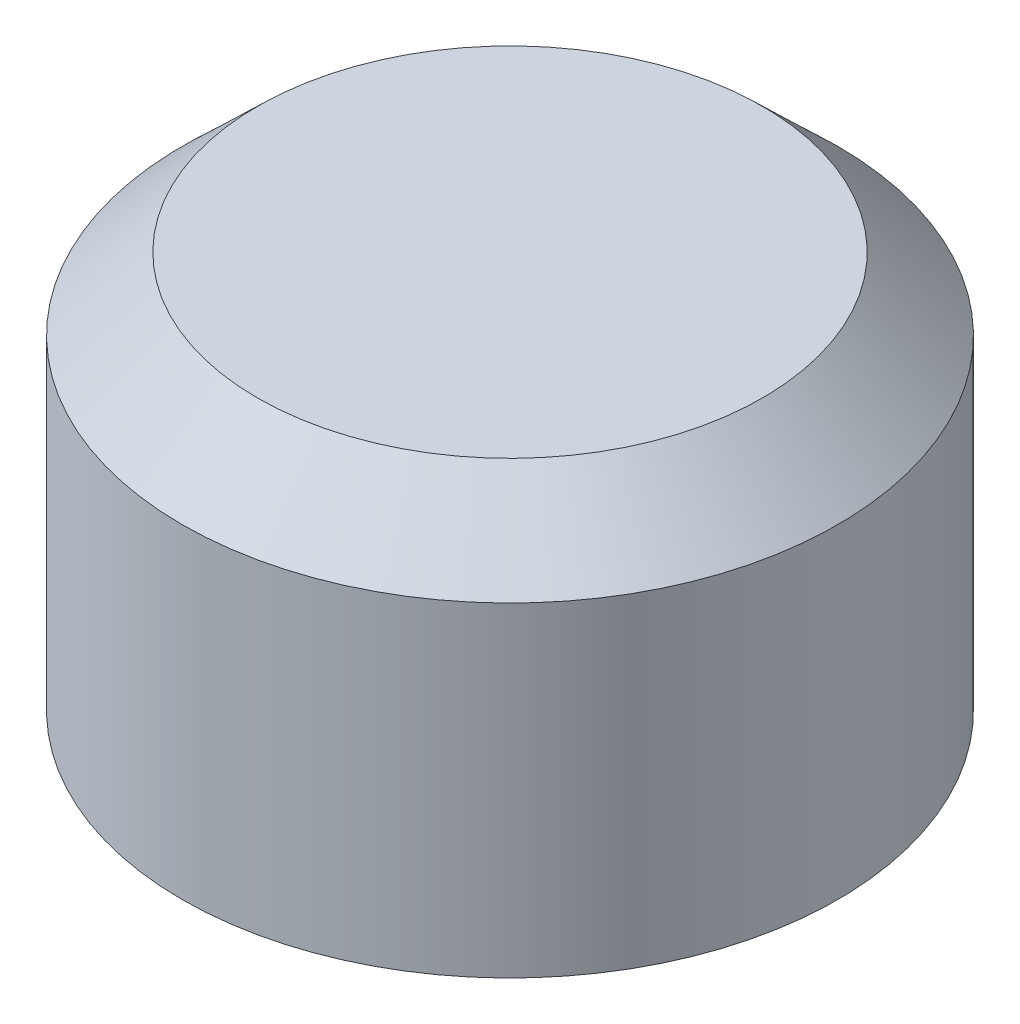
ISO-10303-21;
HEADER;
FILE_DESCRIPTION(('STEP AP214'),'2;1');
FILE_NAME('part.step','',(''),(''),'','','');
FILE_SCHEMA(('AUTOMOTIVE_DESIGN { 1 0 10303 214 1 1 1 1 }'));
ENDSEC;
DATA;
#1=APPLICATION_CONTEXT('core data for automotive mechanical design processes');
#2=APPLICATION_PROTOCOL_DEFINITION('international standard','automotive_design',2000,#1);
#3=PRODUCT_CONTEXT('',#1,'mechanical');
#4=PRODUCT('Part','Part','',(#3));
#5=PRODUCT_RELATED_PRODUCT_CATEGORY('part','',(#4));
#6=PRODUCT_DEFINITION_FORMATION('','',#4);
#7=PRODUCT_DEFINITION_CONTEXT('part definition',#1,'design');
#8=PRODUCT_DEFINITION('design','',#6,#7);
#9=PRODUCT_DEFINITION_SHAPE('','',#8);
#10=(LENGTH_UNIT() NAMED_UNIT(*) SI_UNIT(.MILLI.,.METRE.));
#11=(NAMED_UNIT(*) PLANE_ANGLE_UNIT() SI_UNIT($,.RADIAN.));
#12=(NAMED_UNIT(*) SI_UNIT($,.STERADIAN.) SOLID_ANGLE_UNIT());
#13=UNCERTAINTY_MEASURE_WITH_UNIT(LENGTH_MEASURE(1.E-05),#10,'distance_accuracy_value','');
#14=(GEOMETRIC_REPRESENTATION_CONTEXT(3) GLOBAL_UNCERTAINTY_ASSIGNED_CONTEXT((#13)) GLOBAL_UNIT_ASSIGNED_CONTEXT((#10,
#11,#12)) REPRESENTATION_CONTEXT('',''));
#15=CARTESIAN_POINT('',(0.,0.,0.));
#16=DIRECTION('',(0.,0.,1.));
#17=DIRECTION('',(1.,0.,0.));
#18=AXIS2_PLACEMENT_3D('',#15,#16,#17);
#19=CARTESIAN_POINT('',(0.,3520.44,0.));
#20=DIRECTION('',(0.,1.,0.));
#21=DIRECTION('',(0.,0.,1.));
#22=AXIS2_PLACEMENT_3D('',#19,#20,#21);
#23=CYLINDRICAL_SURFACE('',#22,2743.2);
#24=CARTESIAN_POINT('',(0.,2732.37406594724,0.));
#25=DIRECTION('',(0.,1.,0.));
#26=DIRECTION('',(0.,0.,1.));
#27=AXIS2_PLACEMENT_3D('',#24,#25,#26);
#28=CIRCLE('',#27,2743.2);
#29=CARTESIAN_POINT('',(0.,2732.37406594724,2743.2));
#30=VERTEX_POINT('',#29);
#31=EDGE_CURVE('E72',#30,#30,#28,.T.);
#32=ORIENTED_EDGE('',*,*,#31,.T.);
#33=EDGE_LOOP('',(#32));
#34=FACE_BOUND('',#33,.T.);
#35=CARTESIAN_POINT('',(0.,0.,0.));
#36=DIRECTION('',(0.,1.,0.));
#37=DIRECTION('',(0.,0.,1.));
#38=AXIS2_PLACEMENT_3D('',#35,#36,#37);
#39=CIRCLE('',#38,2743.2);
#40=CARTESIAN_POINT('',(0.,0.,2743.2));
#41=VERTEX_POINT('',#40);
#42=EDGE_CURVE('E11',#41,#41,#39,.T.);
#43=ORIENTED_EDGE('',*,*,#42,.F.);
#44=EDGE_LOOP('',(#43));
#45=FACE_BOUND('',#44,.T.);
#46=ADVANCED_FACE('F45',(#34,#45),#23,.F.);
#47=CARTESIAN_POINT('',(-2743.2,0.,0.));
#48=DIRECTION('',(0.,-1.,0.));
#49=DIRECTION('',(0.,0.,-1.));
#50=AXIS2_PLACEMENT_3D('',#47,#48,#49);
#51=PLANE('',#50);
#52=ORIENTED_EDGE('',*,*,#42,.T.);
#53=EDGE_LOOP('',(#52));
#54=FACE_BOUND('',#53,.T.);
#55=CARTESIAN_POINT('',(0.,0.,0.));
#56=DIRECTION('',(0.,1.,0.));
#57=DIRECTION('',(0.,0.,1.));
#58=AXIS2_PLACEMENT_3D('',#55,#56,#57);
#59=CIRCLE('',#58,2768.6);
#60=CARTESIAN_POINT('',(0.,0.,2768.6));
#61=VERTEX_POINT('',#60);
#62=EDGE_CURVE('E52',#61,#61,#59,.T.);
#63=ORIENTED_EDGE('',*,*,#62,.F.);
#64=EDGE_LOOP('',(#63));
#65=FACE_BOUND('',#64,.T.);
#66=ADVANCED_FACE('F91',(#54,#65),#51,.T.);
#67=CARTESIAN_POINT('',(0.,3520.44,0.));
#68=DIRECTION('',(0.,1.,0.));
#69=DIRECTION('',(0.,0.,1.));
#70=AXIS2_PLACEMENT_3D('',#67,#68,#69);
#71=CYLINDRICAL_SURFACE('',#70,2768.6);
#72=ORIENTED_EDGE('',*,*,#62,.T.);
#73=EDGE_LOOP('',(#72));
#74=FACE_BOUND('',#73,.T.);
#75=CARTESIAN_POINT('',(0.,2743.2,0.));
#76=DIRECTION('',(0.,1.,0.));
#77=DIRECTION('',(0.,0.,1.));
#78=AXIS2_PLACEMENT_3D('',#75,#76,#77);
#79=CIRCLE('',#78,2768.6);
#80=CARTESIAN_POINT('',(0.,2743.2,2768.6));
#81=VERTEX_POINT('',#80);
#82=EDGE_CURVE('E57',#81,#81,#79,.T.);
#83=ORIENTED_EDGE('',*,*,#82,.F.);
#84=EDGE_LOOP('',(#83));
#85=FACE_BOUND('',#84,.T.);
#86=ADVANCED_FACE('F95',(#74,#85),#71,.T.);
#87=CARTESIAN_POINT('',(0.,3352.8,0.));
#88=DIRECTION('',(0.,-1.,0.));
#89=DIRECTION('',(0.,0.,-1.));
#90=AXIS2_PLACEMENT_3D('',#87,#88,#89);
#91=CONICAL_SURFACE('',#90,2133.6,0.805803494083987);
#92=ORIENTED_EDGE('',*,*,#82,.T.);
#93=EDGE_LOOP('',(#92));
#94=FACE_BOUND('',#93,.T.);
#95=CARTESIAN_POINT('',(0.,3352.8,0.));
#96=DIRECTION('',(0.,1.,0.));
#97=DIRECTION('',(0.,0.,1.));
#98=AXIS2_PLACEMENT_3D('',#95,#96,#97);
#99=CIRCLE('',#98,2133.6);
#100=CARTESIAN_POINT('',(0.,3352.8,2133.6));
#101=VERTEX_POINT('',#100);
#102=EDGE_CURVE('E62',#101,#101,#99,.T.);
#103=ORIENTED_EDGE('',*,*,#102,.F.);
#104=EDGE_LOOP('',(#103));
#105=FACE_BOUND('',#104,.T.);
#106=ADVANCED_FACE('F99',(#94,#105),#91,.T.);
#107=CARTESIAN_POINT('',(0.,3352.8,0.));
#108=DIRECTION('',(0.,1.,0.));
#109=DIRECTION('',(0.,0.,1.));
#110=AXIS2_PLACEMENT_3D('',#107,#108,#109);
#111=PLANE('',#110);
#112=ORIENTED_EDGE('',*,*,#102,.T.);
#113=EDGE_LOOP('',(#112));
#114=FACE_BOUND('',#113,.T.);
#115=ADVANCED_FACE('F87',(#114),#111,.T.);
#116=CARTESIAN_POINT('',(-2123.38131869504,3327.4,0.));
#117=DIRECTION('',(0.,-1.,0.));
#118=DIRECTION('',(0.,0.,-1.));
#119=AXIS2_PLACEMENT_3D('',#116,#117,#118);
#120=PLANE('',#119);
#121=CARTESIAN_POINT('',(0.,3327.4,0.));
#122=DIRECTION('',(0.,1.,0.));
#123=DIRECTION('',(0.,0.,1.));
#124=AXIS2_PLACEMENT_3D('',#121,#122,#123);
#125=CIRCLE('',#124,2123.38131869504);
#126=CARTESIAN_POINT('',(0.,3327.4,2123.38131869504));
#127=VERTEX_POINT('',#126);
#128=EDGE_CURVE('E68',#127,#127,#125,.T.);
#129=ORIENTED_EDGE('',*,*,#128,.F.);
#130=EDGE_LOOP('',(#129));
#131=FACE_BOUND('',#130,.T.);
#132=ADVANCED_FACE('F81',(#131),#120,.T.);
#133=CARTESIAN_POINT('',(0.,2732.37406594724,0.));
#134=DIRECTION('',(0.,-1.,0.));
#135=DIRECTION('',(0.,0.,-1.));
#136=AXIS2_PLACEMENT_3D('',#133,#134,#135);
#137=CONICAL_SURFACE('',#136,2743.2,0.805803494083986);
#138=ORIENTED_EDGE('',*,*,#128,.T.);
#139=EDGE_LOOP('',(#138));
#140=FACE_BOUND('',#139,.T.);
#141=ORIENTED_EDGE('',*,*,#31,.F.);
#142=EDGE_LOOP('',(#141));
#143=FACE_BOUND('',#142,.T.);
#144=ADVANCED_FACE('F79',(#140,#143),#137,.F.);
#145=CLOSED_SHELL('',(#46,#66,#86,#106,#115,#132,#144));
#146=MANIFOLD_SOLID_BREP('B2',#145);
#147=CARTESIAN_POINT('',(-2413.,0.,0.));
#148=DIRECTION('',(0.,-1.,0.));
#149=DIRECTION('',(0.,0.,-1.));
#150=AXIS2_PLACEMENT_3D('',#147,#148,#149);
#151=PLANE('',#150);
#152=CARTESIAN_POINT('',(0.,0.,0.));
#153=DIRECTION('',(0.,1.,0.));
#154=DIRECTION('',(0.,0.,1.));
#155=AXIS2_PLACEMENT_3D('',#152,#153,#154);
#156=CIRCLE('',#155,2413.);
#157=CARTESIAN_POINT('',(0.,0.,2413.));
#158=VERTEX_POINT('',#157);
#159=EDGE_CURVE('E198',#158,#158,#156,.T.);
#160=ORIENTED_EDGE('',*,*,#159,.T.);
#161=EDGE_LOOP('',(#160));
#162=FACE_BOUND('',#161,.T.);
#163=CARTESIAN_POINT('',(0.,0.,0.));
#164=DIRECTION('',(0.,1.,0.));
#165=DIRECTION('',(0.,0.,1.));
#166=AXIS2_PLACEMENT_3D('',#163,#164,#165);
#167=CIRCLE('',#166,2438.4);
#168=CARTESIAN_POINT('',(0.,0.,2438.4));
#169=VERTEX_POINT('',#168);
#170=EDGE_CURVE('E44',#169,#169,#167,.T.);
#171=ORIENTED_EDGE('',*,*,#170,.F.);
#172=EDGE_LOOP('',(#171));
#173=FACE_BOUND('',#172,.T.);
#174=ADVANCED_FACE('F152',(#162,#173),#151,.T.);
#175=CARTESIAN_POINT('',(0.,3520.44,0.));
#176=DIRECTION('',(0.,1.,0.));
#177=DIRECTION('',(0.,0.,1.));
#178=AXIS2_PLACEMENT_3D('',#175,#176,#177);
#179=CYLINDRICAL_SURFACE('',#178,2438.4);
#180=ORIENTED_EDGE('',*,*,#170,.T.);
#181=EDGE_LOOP('',(#180));
#182=FACE_BOUND('',#181,.T.);
#183=CARTESIAN_POINT('',(0.,2753.72102448428,0.));
#184=DIRECTION('',(0.,1.,0.));
#185=DIRECTION('',(0.,0.,1.));
#186=AXIS2_PLACEMENT_3D('',#183,#184,#185);
#187=CIRCLE('',#186,2438.4);
#188=CARTESIAN_POINT('',(0.,2753.72102448428,2438.4));
#189=VERTEX_POINT('',#188);
#190=EDGE_CURVE('E158',#189,#189,#187,.T.);
#191=ORIENTED_EDGE('',*,*,#190,.F.);
#192=EDGE_LOOP('',(#191));
#193=FACE_BOUND('',#192,.T.);
#194=ADVANCED_FACE('F216',(#182,#193),#179,.T.);
#195=CARTESIAN_POINT('',(0.,3073.4,0.));
#196=DIRECTION('',(0.,-1.,0.));
#197=DIRECTION('',(0.,0.,-1.));
#198=AXIS2_PLACEMENT_3D('',#195,#196,#197);
#199=CONICAL_SURFACE('',#198,2118.72102448428,0.785398163397448);
#200=ORIENTED_EDGE('',*,*,#190,.T.);
#201=EDGE_LOOP('',(#200));
#202=FACE_BOUND('',#201,.T.);
#203=CARTESIAN_POINT('',(0.,3073.4,0.));
#204=DIRECTION('',(0.,1.,0.));
#205=DIRECTION('',(0.,0.,1.));
#206=AXIS2_PLACEMENT_3D('',#203,#204,#205);
#207=CIRCLE('',#206,2118.72102448428);
#208=CARTESIAN_POINT('',(0.,3073.4,2118.72102448428));
#209=VERTEX_POINT('',#208);
#210=EDGE_CURVE('E162',#209,#209,#207,.T.);
#211=ORIENTED_EDGE('',*,*,#210,.F.);
#212=EDGE_LOOP('',(#211));
#213=FACE_BOUND('',#212,.T.);
#214=ADVANCED_FACE('F220',(#202,#213),#199,.T.);
#215=CARTESIAN_POINT('',(-2118.72102448428,3073.4,0.));
#216=DIRECTION('',(0.,1.,0.));
#217=DIRECTION('',(0.,0.,1.));
#218=AXIS2_PLACEMENT_3D('',#215,#216,#217);
#219=PLANE('',#218);
#220=ORIENTED_EDGE('',*,*,#210,.T.);
#221=EDGE_LOOP('',(#220));
#222=FACE_BOUND('',#221,.T.);
#223=CARTESIAN_POINT('',(0.,3073.4,0.));
#224=DIRECTION('',(0.,1.,0.));
#225=DIRECTION('',(0.,0.,1.));
#226=AXIS2_PLACEMENT_3D('',#223,#224,#225);
#227=CIRCLE('',#226,1190.87720649982);
#228=CARTESIAN_POINT('',(0.,3073.4,1190.87720649982));
#229=VERTEX_POINT('',#228);
#230=EDGE_CURVE('E166',#229,#229,#227,.T.);
#231=ORIENTED_EDGE('',*,*,#230,.F.);
#232=EDGE_LOOP('',(#231));
#233=FACE_BOUND('',#232,.T.);
#234=ADVANCED_FACE('F224',(#222,#233),#219,.T.);
#235=CARTESIAN_POINT('',(0.,2796.92279350018,0.));
#236=DIRECTION('',(0.,1.,0.));
#237=DIRECTION('',(0.,0.,1.));
#238=AXIS2_PLACEMENT_3D('',#235,#236,#237);
#239=CONICAL_SURFACE('',#238,914.400000000001,0.785398163397449);
#240=ORIENTED_EDGE('',*,*,#230,.T.);
#241=EDGE_LOOP('',(#240));
#242=FACE_BOUND('',#241,.T.);
#243=CARTESIAN_POINT('',(0.,2796.92279350018,0.));
#244=DIRECTION('',(0.,1.,0.));
#245=DIRECTION('',(0.,0.,1.));
#246=AXIS2_PLACEMENT_3D('',#243,#244,#245);
#247=CIRCLE('',#246,914.400000000001);
#248=CARTESIAN_POINT('',(0.,2796.92279350018,914.400000000001));
#249=VERTEX_POINT('',#248);
#250=EDGE_CURVE('E171',#249,#249,#247,.T.);
#251=ORIENTED_EDGE('',*,*,#250,.F.);
#252=EDGE_LOOP('',(#251));
#253=FACE_BOUND('',#252,.T.);
#254=ADVANCED_FACE('F230',(#242,#253),#239,.F.);
#255=CARTESIAN_POINT('',(0.,3520.44,0.));
#256=DIRECTION('',(0.,1.,0.));
#257=DIRECTION('',(0.,0.,1.));
#258=AXIS2_PLACEMENT_3D('',#255,#256,#257);
#259=CYLINDRICAL_SURFACE('',#258,914.4);
#260=ORIENTED_EDGE('',*,*,#250,.T.);
#261=EDGE_LOOP('',(#260));
#262=FACE_BOUND('',#261,.T.);
#263=CARTESIAN_POINT('',(0.,2074.,0.));
#264=DIRECTION('',(0.,1.,0.));
#265=DIRECTION('',(0.,0.,1.));
#266=AXIS2_PLACEMENT_3D('',#263,#264,#265);
#267=CIRCLE('',#266,914.4);
#268=CARTESIAN_POINT('',(0.,2074.,914.4));
#269=VERTEX_POINT('',#268);
#270=EDGE_CURVE('E174',#269,#269,#267,.T.);
#271=ORIENTED_EDGE('',*,*,#270,.F.);
#272=EDGE_LOOP('',(#271));
#273=FACE_BOUND('',#272,.T.);
#274=ADVANCED_FACE('F234',(#262,#273),#259,.F.);
#275=CARTESIAN_POINT('',(0.,1523.86069807987,0.));
#276=DIRECTION('',(0.,1.,0.));
#277=DIRECTION('',(0.,0.,1.));
#278=AXIS2_PLACEMENT_3D('',#275,#276,#277);
#279=CONICAL_SURFACE('',#278,766.990618325879,0.261799387799151);
#280=ORIENTED_EDGE('',*,*,#270,.T.);
#281=EDGE_LOOP('',(#280));
#282=FACE_BOUND('',#281,.T.);
#283=CARTESIAN_POINT('',(0.,1523.86069807987,0.));
#284=DIRECTION('',(0.,1.,0.));
#285=DIRECTION('',(0.,0.,1.));
#286=AXIS2_PLACEMENT_3D('',#283,#284,#285);
#287=CIRCLE('',#286,766.990618325879);
#288=CARTESIAN_POINT('',(0.,1523.86069807987,766.990618325879));
#289=VERTEX_POINT('',#288);
#290=EDGE_CURVE('E177',#289,#289,#287,.T.);
#291=ORIENTED_EDGE('',*,*,#290,.F.);
#292=EDGE_LOOP('',(#291));
#293=FACE_BOUND('',#292,.T.);
#294=ADVANCED_FACE('F238',(#282,#293),#279,.F.);
#295=CARTESIAN_POINT('',(-766.990618325879,1523.86069807987,0.));
#296=DIRECTION('',(0.,-1.,0.));
#297=DIRECTION('',(0.,0.,-1.));
#298=AXIS2_PLACEMENT_3D('',#295,#296,#297);
#299=PLANE('',#298);
#300=ORIENTED_EDGE('',*,*,#290,.T.);
#301=EDGE_LOOP('',(#300));
#302=FACE_BOUND('',#301,.T.);
#303=CARTESIAN_POINT('',(0.,1523.86069807987,0.));
#304=DIRECTION('',(0.,1.,0.));
#305=DIRECTION('',(0.,0.,1.));
#306=AXIS2_PLACEMENT_3D('',#303,#304,#305);
#307=CIRCLE('',#306,792.390618325879);
#308=CARTESIAN_POINT('',(0.,1523.86069807987,792.390618325879));
#309=VERTEX_POINT('',#308);
#310=EDGE_CURVE('E180',#309,#309,#307,.T.);
#311=ORIENTED_EDGE('',*,*,#310,.F.);
#312=EDGE_LOOP('',(#311));
#313=FACE_BOUND('',#312,.T.);
#314=ADVANCED_FACE('F242',(#302,#313),#299,.T.);
#315=CARTESIAN_POINT('',(0.,2074.,0.));
#316=DIRECTION('',(0.,1.,0.));
#317=DIRECTION('',(0.,0.,1.));
#318=AXIS2_PLACEMENT_3D('',#315,#316,#317);
#319=CONICAL_SURFACE('',#318,939.8,0.26179938779915);
#320=ORIENTED_EDGE('',*,*,#310,.T.);
#321=EDGE_LOOP('',(#320));
#322=FACE_BOUND('',#321,.T.);
#323=CARTESIAN_POINT('',(0.,2074.,0.));
#324=DIRECTION('',(0.,1.,0.));
#325=DIRECTION('',(0.,0.,1.));
#326=AXIS2_PLACEMENT_3D('',#323,#324,#325);
#327=CIRCLE('',#326,939.8);
#328=CARTESIAN_POINT('',(0.,2074.,939.8));
#329=VERTEX_POINT('',#328);
#330=EDGE_CURVE('E183',#329,#329,#327,.T.);
#331=ORIENTED_EDGE('',*,*,#330,.F.);
#332=EDGE_LOOP('',(#331));
#333=FACE_BOUND('',#332,.T.);
#334=ADVANCED_FACE('F246',(#322,#333),#319,.T.);
#335=CARTESIAN_POINT('',(0.,3520.44,0.));
#336=DIRECTION('',(0.,1.,0.));
#337=DIRECTION('',(0.,0.,1.));
#338=AXIS2_PLACEMENT_3D('',#335,#336,#337);
#339=CYLINDRICAL_SURFACE('',#338,939.8);
#340=ORIENTED_EDGE('',*,*,#330,.T.);
#341=EDGE_LOOP('',(#340));
#342=FACE_BOUND('',#341,.T.);
#343=CARTESIAN_POINT('',(0.,2786.4017690159,0.));
#344=DIRECTION('',(0.,1.,0.));
#345=DIRECTION('',(0.,0.,1.));
#346=AXIS2_PLACEMENT_3D('',#343,#344,#345);
#347=CIRCLE('',#346,939.8);
#348=CARTESIAN_POINT('',(0.,2786.4017690159,939.8));
#349=VERTEX_POINT('',#348);
#350=EDGE_CURVE('E186',#349,#349,#347,.T.);
#351=ORIENTED_EDGE('',*,*,#350,.F.);
#352=EDGE_LOOP('',(#351));
#353=FACE_BOUND('',#352,.T.);
#354=ADVANCED_FACE('F250',(#342,#353),#339,.T.);
#355=CARTESIAN_POINT('',(0.,3048.,0.));
#356=DIRECTION('',(0.,1.,0.));
#357=DIRECTION('',(0.,0.,1.));
#358=AXIS2_PLACEMENT_3D('',#355,#356,#357);
#359=CONICAL_SURFACE('',#358,1201.3982309841,0.785398163397449);
#360=ORIENTED_EDGE('',*,*,#350,.T.);
#361=EDGE_LOOP('',(#360));
#362=FACE_BOUND('',#361,.T.);
#363=CARTESIAN_POINT('',(0.,3048.,0.));
#364=DIRECTION('',(0.,1.,0.));
#365=DIRECTION('',(0.,0.,1.));
#366=AXIS2_PLACEMENT_3D('',#363,#364,#365);
#367=CIRCLE('',#366,1201.3982309841);
#368=CARTESIAN_POINT('',(0.,3048.,1201.3982309841));
#369=VERTEX_POINT('',#368);
#370=EDGE_CURVE('E189',#369,#369,#367,.T.);
#371=ORIENTED_EDGE('',*,*,#370,.F.);
#372=EDGE_LOOP('',(#371));
#373=FACE_BOUND('',#372,.T.);
#374=ADVANCED_FACE('F254',(#362,#373),#359,.T.);
#375=CARTESIAN_POINT('',(-1201.3982309841,3048.,0.));
#376=DIRECTION('',(0.,-1.,0.));
#377=DIRECTION('',(0.,0.,-1.));
#378=AXIS2_PLACEMENT_3D('',#375,#376,#377);
#379=PLANE('',#378);
#380=ORIENTED_EDGE('',*,*,#370,.T.);
#381=EDGE_LOOP('',(#380));
#382=FACE_BOUND('',#381,.T.);
#383=CARTESIAN_POINT('',(0.,3048.,0.));
#384=DIRECTION('',(0.,1.,0.));
#385=DIRECTION('',(0.,0.,1.));
#386=AXIS2_PLACEMENT_3D('',#383,#384,#385);
#387=CIRCLE('',#386,2108.2);
#388=CARTESIAN_POINT('',(0.,3048.,2108.2));
#389=VERTEX_POINT('',#388);
#390=EDGE_CURVE('E192',#389,#389,#387,.T.);
#391=ORIENTED_EDGE('',*,*,#390,.F.);
#392=EDGE_LOOP('',(#391));
#393=FACE_BOUND('',#392,.T.);
#394=ADVANCED_FACE('F212',(#382,#393),#379,.T.);
#395=CARTESIAN_POINT('',(0.,2743.2,0.));
#396=DIRECTION('',(0.,-1.,0.));
#397=DIRECTION('',(0.,0.,-1.));
#398=AXIS2_PLACEMENT_3D('',#395,#396,#397);
#399=CONICAL_SURFACE('',#398,2413.,0.785398163397448);
#400=ORIENTED_EDGE('',*,*,#390,.T.);
#401=EDGE_LOOP('',(#400));
#402=FACE_BOUND('',#401,.T.);
#403=CARTESIAN_POINT('',(0.,2743.2,0.));
#404=DIRECTION('',(0.,1.,0.));
#405=DIRECTION('',(0.,0.,1.));
#406=AXIS2_PLACEMENT_3D('',#403,#404,#405);
#407=CIRCLE('',#406,2413.);
#408=CARTESIAN_POINT('',(0.,2743.2,2413.));
#409=VERTEX_POINT('',#408);
#410=EDGE_CURVE('E195',#409,#409,#407,.T.);
#411=ORIENTED_EDGE('',*,*,#410,.F.);
#412=EDGE_LOOP('',(#411));
#413=FACE_BOUND('',#412,.T.);
#414=ADVANCED_FACE('F206',(#402,#413),#399,.F.);
#415=CARTESIAN_POINT('',(0.,3520.44,0.));
#416=DIRECTION('',(0.,1.,0.));
#417=DIRECTION('',(0.,0.,1.));
#418=AXIS2_PLACEMENT_3D('',#415,#416,#417);
#419=CYLINDRICAL_SURFACE('',#418,2413.);
#420=ORIENTED_EDGE('',*,*,#410,.T.);
#421=EDGE_LOOP('',(#420));
#422=FACE_BOUND('',#421,.T.);
#423=ORIENTED_EDGE('',*,*,#159,.F.);
#424=EDGE_LOOP('',(#423));
#425=FACE_BOUND('',#424,.T.);
#426=ADVANCED_FACE('F204',(#422,#425),#419,.F.);
#427=CLOSED_SHELL('',(#174,#194,#214,#234,#254,#274,#294,#314,#334,#354,#374,#394,#414,#426));
#428=MANIFOLD_SOLID_BREP('B6',#427);
#429=ADVANCED_BREP_SHAPE_REPRESENTATION('',(#18,#146,#428),#14);
#430=SHAPE_DEFINITION_REPRESENTATION(#9,#429);
ENDSEC;
END-ISO-10303-21;
